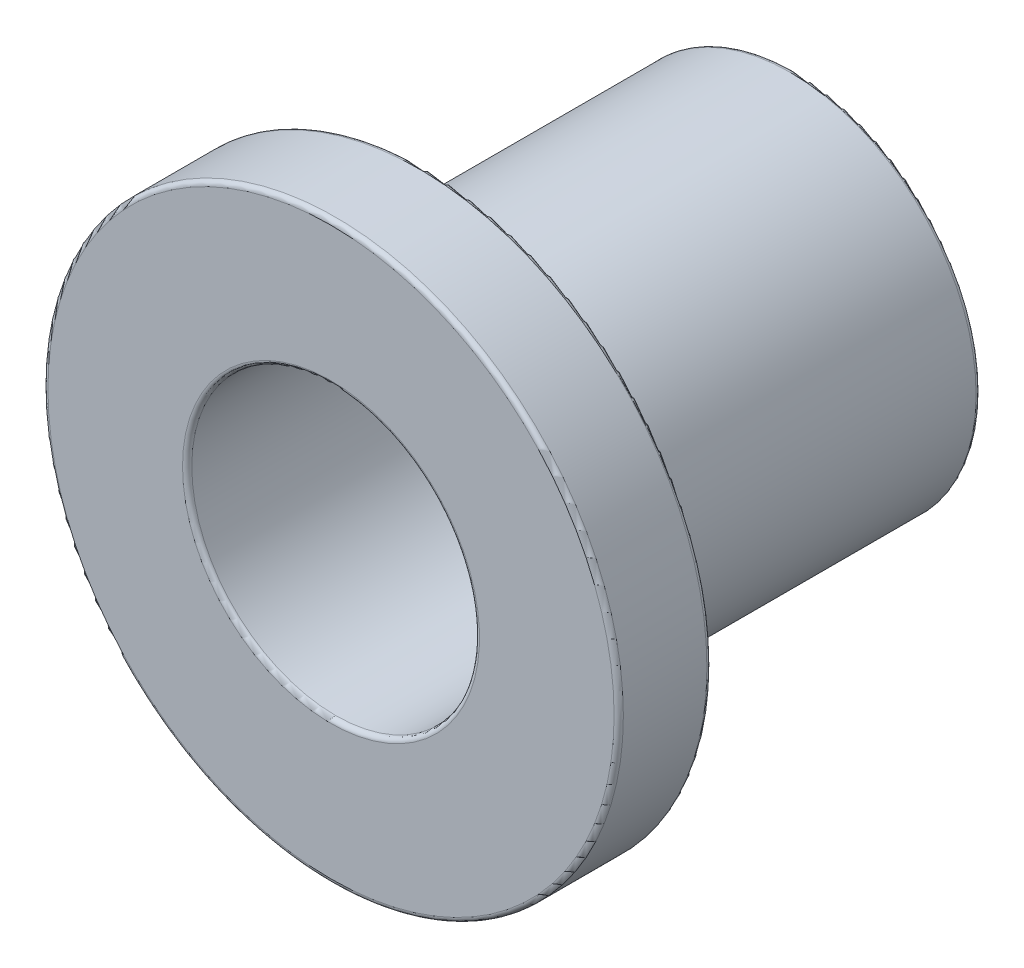
ISO-10303-21;
HEADER;
FILE_DESCRIPTION(('STEP AP214'),'2;1');
FILE_NAME('part.step','',(''),(''),'','','');
FILE_SCHEMA(('AUTOMOTIVE_DESIGN { 1 0 10303 214 1 1 1 1 }'));
ENDSEC;
DATA;
#1=APPLICATION_CONTEXT('core data for automotive mechanical design processes');
#2=APPLICATION_PROTOCOL_DEFINITION('international standard','automotive_design',2000,#1);
#3=PRODUCT_CONTEXT('',#1,'mechanical');
#4=PRODUCT('Part','Part','',(#3));
#5=PRODUCT_RELATED_PRODUCT_CATEGORY('part','',(#4));
#6=PRODUCT_DEFINITION_FORMATION('','',#4);
#7=PRODUCT_DEFINITION_CONTEXT('part definition',#1,'design');
#8=PRODUCT_DEFINITION('design','',#6,#7);
#9=PRODUCT_DEFINITION_SHAPE('','',#8);
#10=(LENGTH_UNIT() NAMED_UNIT(*) SI_UNIT(.MILLI.,.METRE.));
#11=(NAMED_UNIT(*) PLANE_ANGLE_UNIT() SI_UNIT($,.RADIAN.));
#12=(NAMED_UNIT(*) SI_UNIT($,.STERADIAN.) SOLID_ANGLE_UNIT());
#13=UNCERTAINTY_MEASURE_WITH_UNIT(LENGTH_MEASURE(1.E-05),#10,'distance_accuracy_value','');
#14=(GEOMETRIC_REPRESENTATION_CONTEXT(3) GLOBAL_UNCERTAINTY_ASSIGNED_CONTEXT((#13)) GLOBAL_UNIT_ASSIGNED_CONTEXT((#10,
#11,#12)) REPRESENTATION_CONTEXT('',''));
#15=CARTESIAN_POINT('',(0.,0.,0.));
#16=DIRECTION('',(0.,0.,1.));
#17=DIRECTION('',(1.,0.,0.));
#18=AXIS2_PLACEMENT_3D('',#15,#16,#17);
#19=CARTESIAN_POINT('',(0.,3.1,2.5));
#20=DIRECTION('',(0.,0.,-1.));
#21=DIRECTION('',(-1.,0.,0.));
#22=AXIS2_PLACEMENT_3D('',#19,#20,#21);
#23=PLANE('',#22);
#24=CARTESIAN_POINT('',(0.,0.,2.5));
#25=DIRECTION('',(0.,0.,-1.));
#26=DIRECTION('',(-1.,0.,0.));
#27=AXIS2_PLACEMENT_3D('',#24,#25,#26);
#28=CIRCLE('',#27,1.6);
#29=CARTESIAN_POINT('',(-1.6,0.,2.5));
#30=VERTEX_POINT('',#29);
#31=EDGE_CURVE('E62',#30,#30,#28,.T.);
#32=ORIENTED_EDGE('',*,*,#31,.T.);
#33=EDGE_LOOP('',(#32));
#34=FACE_BOUND('',#33,.T.);
#35=CARTESIAN_POINT('',(0.,0.,2.5));
#36=DIRECTION('',(0.,0.,-1.));
#37=DIRECTION('',(-1.,0.,0.));
#38=AXIS2_PLACEMENT_3D('',#35,#36,#37);
#39=CIRCLE('',#38,3.05);
#40=CARTESIAN_POINT('',(-3.05,0.,2.5));
#41=VERTEX_POINT('',#40);
#42=EDGE_CURVE('E65',#41,#41,#39,.F.);
#43=ORIENTED_EDGE('',*,*,#42,.T.);
#44=EDGE_LOOP('',(#43));
#45=FACE_BOUND('',#44,.T.);
#46=ADVANCED_FACE('F30',(#34,#45),#23,.F.);
#47=CARTESIAN_POINT('',(0.,0.,2.5));
#48=DIRECTION('',(0.,0.,1.));
#49=DIRECTION('',(1.,0.,0.));
#50=AXIS2_PLACEMENT_3D('',#47,#48,#49);
#51=CYLINDRICAL_SURFACE('',#50,1.55);
#52=CARTESIAN_POINT('',(0.,0.,2.45));
#53=DIRECTION('',(0.,0.,-1.));
#54=DIRECTION('',(-1.,0.,0.));
#55=AXIS2_PLACEMENT_3D('',#52,#53,#54);
#56=CIRCLE('',#55,1.55);
#57=CARTESIAN_POINT('',(-1.55,0.,2.45));
#58=VERTEX_POINT('',#57);
#59=EDGE_CURVE('E68',#58,#58,#56,.F.);
#60=ORIENTED_EDGE('',*,*,#59,.T.);
#61=EDGE_LOOP('',(#60));
#62=FACE_BOUND('',#61,.T.);
#63=CARTESIAN_POINT('',(0.,0.,-2.45));
#64=DIRECTION('',(0.,0.,1.));
#65=DIRECTION('',(1.,0.,0.));
#66=AXIS2_PLACEMENT_3D('',#63,#64,#65);
#67=CIRCLE('',#66,1.55);
#68=CARTESIAN_POINT('',(1.55,0.,-2.45));
#69=VERTEX_POINT('',#68);
#70=EDGE_CURVE('E71',#69,#69,#67,.F.);
#71=ORIENTED_EDGE('',*,*,#70,.T.);
#72=EDGE_LOOP('',(#71));
#73=FACE_BOUND('',#72,.T.);
#74=ADVANCED_FACE('F75',(#62,#73),#51,.F.);
#75=CARTESIAN_POINT('',(0.,1.55,-2.5));
#76=DIRECTION('',(0.,0.,1.));
#77=DIRECTION('',(1.,0.,0.));
#78=AXIS2_PLACEMENT_3D('',#75,#76,#77);
#79=PLANE('',#78);
#80=CARTESIAN_POINT('',(0.,0.,-2.5));
#81=DIRECTION('',(0.,0.,1.));
#82=DIRECTION('',(1.,0.,0.));
#83=AXIS2_PLACEMENT_3D('',#80,#81,#82);
#84=CIRCLE('',#83,1.6);
#85=CARTESIAN_POINT('',(1.6,0.,-2.5));
#86=VERTEX_POINT('',#85);
#87=EDGE_CURVE('E56',#86,#86,#84,.T.);
#88=ORIENTED_EDGE('',*,*,#87,.T.);
#89=EDGE_LOOP('',(#88));
#90=FACE_BOUND('',#89,.T.);
#91=CARTESIAN_POINT('',(0.,0.,-2.5));
#92=DIRECTION('',(0.,0.,1.));
#93=DIRECTION('',(1.,0.,0.));
#94=AXIS2_PLACEMENT_3D('',#91,#92,#93);
#95=CIRCLE('',#94,1.95);
#96=CARTESIAN_POINT('',(1.95,0.,-2.5));
#97=VERTEX_POINT('',#96);
#98=EDGE_CURVE('E59',#97,#97,#95,.F.);
#99=ORIENTED_EDGE('',*,*,#98,.T.);
#100=EDGE_LOOP('',(#99));
#101=FACE_BOUND('',#100,.T.);
#102=ADVANCED_FACE('F85',(#90,#101),#79,.F.);
#103=CARTESIAN_POINT('',(0.,0.,2.5));
#104=DIRECTION('',(0.,0.,1.));
#105=DIRECTION('',(1.,0.,0.));
#106=AXIS2_PLACEMENT_3D('',#103,#104,#105);
#107=CYLINDRICAL_SURFACE('',#106,2.);
#108=CARTESIAN_POINT('',(0.,0.,-2.45));
#109=DIRECTION('',(0.,0.,1.));
#110=DIRECTION('',(1.,0.,0.));
#111=AXIS2_PLACEMENT_3D('',#108,#109,#110);
#112=CIRCLE('',#111,2.);
#113=CARTESIAN_POINT('',(2.,0.,-2.45));
#114=VERTEX_POINT('',#113);
#115=EDGE_CURVE('E50',#114,#114,#112,.T.);
#116=ORIENTED_EDGE('',*,*,#115,.T.);
#117=EDGE_LOOP('',(#116));
#118=FACE_BOUND('',#117,.T.);
#119=CARTESIAN_POINT('',(0.,0.,1.45));
#120=DIRECTION('',(0.,0.,1.));
#121=DIRECTION('',(1.,0.,0.));
#122=AXIS2_PLACEMENT_3D('',#119,#120,#121);
#123=CIRCLE('',#122,2.);
#124=CARTESIAN_POINT('',(2.,0.,1.45));
#125=VERTEX_POINT('',#124);
#126=EDGE_CURVE('E53',#125,#125,#123,.F.);
#127=ORIENTED_EDGE('',*,*,#126,.T.);
#128=EDGE_LOOP('',(#127));
#129=FACE_BOUND('',#128,.T.);
#130=ADVANCED_FACE('F88',(#118,#129),#107,.T.);
#131=CARTESIAN_POINT('',(0.,2.,1.5));
#132=DIRECTION('',(0.,0.,1.));
#133=DIRECTION('',(1.,0.,0.));
#134=AXIS2_PLACEMENT_3D('',#131,#132,#133);
#135=PLANE('',#134);
#136=CARTESIAN_POINT('',(0.,0.,1.5));
#137=DIRECTION('',(0.,0.,1.));
#138=DIRECTION('',(1.,0.,0.));
#139=AXIS2_PLACEMENT_3D('',#136,#137,#138);
#140=CIRCLE('',#139,2.05);
#141=CARTESIAN_POINT('',(2.05,0.,1.5));
#142=VERTEX_POINT('',#141);
#143=EDGE_CURVE('E41',#142,#142,#140,.T.);
#144=ORIENTED_EDGE('',*,*,#143,.T.);
#145=EDGE_LOOP('',(#144));
#146=FACE_BOUND('',#145,.T.);
#147=CARTESIAN_POINT('',(0.,0.,1.5));
#148=DIRECTION('',(0.,0.,1.));
#149=DIRECTION('',(1.,0.,0.));
#150=AXIS2_PLACEMENT_3D('',#147,#148,#149);
#151=CIRCLE('',#150,3.05);
#152=CARTESIAN_POINT('',(3.05,0.,1.5));
#153=VERTEX_POINT('',#152);
#154=EDGE_CURVE('E45',#153,#153,#151,.F.);
#155=ORIENTED_EDGE('',*,*,#154,.T.);
#156=EDGE_LOOP('',(#155));
#157=FACE_BOUND('',#156,.T.);
#158=ADVANCED_FACE('F100',(#146,#157),#135,.F.);
#159=CARTESIAN_POINT('',(0.,0.,2.5));
#160=DIRECTION('',(0.,0.,1.));
#161=DIRECTION('',(1.,0.,0.));
#162=AXIS2_PLACEMENT_3D('',#159,#160,#161);
#163=CYLINDRICAL_SURFACE('',#162,3.1);
#164=CARTESIAN_POINT('',(0.,0.,1.55));
#165=DIRECTION('',(0.,0.,1.));
#166=DIRECTION('',(1.,0.,0.));
#167=AXIS2_PLACEMENT_3D('',#164,#165,#166);
#168=CIRCLE('',#167,3.1);
#169=CARTESIAN_POINT('',(3.1,0.,1.55));
#170=VERTEX_POINT('',#169);
#171=EDGE_CURVE('E10',#170,#170,#168,.T.);
#172=ORIENTED_EDGE('',*,*,#171,.T.);
#173=EDGE_LOOP('',(#172));
#174=FACE_BOUND('',#173,.T.);
#175=CARTESIAN_POINT('',(0.,0.,2.45));
#176=DIRECTION('',(0.,0.,-1.));
#177=DIRECTION('',(-1.,0.,0.));
#178=AXIS2_PLACEMENT_3D('',#175,#176,#177);
#179=CIRCLE('',#178,3.1);
#180=CARTESIAN_POINT('',(-3.1,0.,2.45));
#181=VERTEX_POINT('',#180);
#182=EDGE_CURVE('E37',#181,#181,#179,.T.);
#183=ORIENTED_EDGE('',*,*,#182,.T.);
#184=EDGE_LOOP('',(#183));
#185=FACE_BOUND('',#184,.T.);
#186=ADVANCED_FACE('F112',(#174,#185),#163,.T.);
#187=CARTESIAN_POINT('',(0.,0.,2.45));
#188=DIRECTION('',(0.,0.,-1.));
#189=DIRECTION('',(-1.,0.,0.));
#190=AXIS2_PLACEMENT_3D('',#187,#188,#189);
#191=TOROIDAL_SURFACE('',#190,1.6,0.05);
#192=ORIENTED_EDGE('',*,*,#31,.F.);
#193=EDGE_LOOP('',(#192));
#194=FACE_BOUND('',#193,.T.);
#195=ORIENTED_EDGE('',*,*,#59,.F.);
#196=EDGE_LOOP('',(#195));
#197=FACE_BOUND('',#196,.T.);
#198=ADVANCED_FACE('F81',(#194,#197),#191,.T.);
#199=CARTESIAN_POINT('',(0.,0.,-2.45));
#200=DIRECTION('',(0.,0.,1.));
#201=DIRECTION('',(1.,0.,0.));
#202=AXIS2_PLACEMENT_3D('',#199,#200,#201);
#203=TOROIDAL_SURFACE('',#202,1.6,0.05);
#204=ORIENTED_EDGE('',*,*,#70,.F.);
#205=EDGE_LOOP('',(#204));
#206=FACE_BOUND('',#205,.T.);
#207=ORIENTED_EDGE('',*,*,#87,.F.);
#208=EDGE_LOOP('',(#207));
#209=FACE_BOUND('',#208,.T.);
#210=ADVANCED_FACE('F77',(#206,#209),#203,.T.);
#211=CARTESIAN_POINT('',(0.,0.,-2.45));
#212=DIRECTION('',(0.,0.,1.));
#213=DIRECTION('',(1.,0.,0.));
#214=AXIS2_PLACEMENT_3D('',#211,#212,#213);
#215=TOROIDAL_SURFACE('',#214,1.95,0.05);
#216=ORIENTED_EDGE('',*,*,#98,.F.);
#217=EDGE_LOOP('',(#216));
#218=FACE_BOUND('',#217,.T.);
#219=ORIENTED_EDGE('',*,*,#115,.F.);
#220=EDGE_LOOP('',(#219));
#221=FACE_BOUND('',#220,.T.);
#222=ADVANCED_FACE('F80',(#218,#221),#215,.T.);
#223=CARTESIAN_POINT('',(0.,0.,1.45));
#224=DIRECTION('',(0.,0.,1.));
#225=DIRECTION('',(1.,0.,0.));
#226=AXIS2_PLACEMENT_3D('',#223,#224,#225);
#227=TOROIDAL_SURFACE('',#226,2.05,0.05);
#228=ORIENTED_EDGE('',*,*,#126,.F.);
#229=EDGE_LOOP('',(#228));
#230=FACE_BOUND('',#229,.T.);
#231=ORIENTED_EDGE('',*,*,#143,.F.);
#232=EDGE_LOOP('',(#231));
#233=FACE_BOUND('',#232,.T.);
#234=ADVANCED_FACE('F94',(#230,#233),#227,.F.);
#235=CARTESIAN_POINT('',(0.,0.,1.55));
#236=DIRECTION('',(0.,0.,1.));
#237=DIRECTION('',(1.,0.,0.));
#238=AXIS2_PLACEMENT_3D('',#235,#236,#237);
#239=TOROIDAL_SURFACE('',#238,3.05,0.05);
#240=ORIENTED_EDGE('',*,*,#154,.F.);
#241=EDGE_LOOP('',(#240));
#242=FACE_BOUND('',#241,.T.);
#243=ORIENTED_EDGE('',*,*,#171,.F.);
#244=EDGE_LOOP('',(#243));
#245=FACE_BOUND('',#244,.T.);
#246=ADVANCED_FACE('F106',(#242,#245),#239,.T.);
#247=CARTESIAN_POINT('',(0.,0.,2.45));
#248=DIRECTION('',(0.,0.,-1.));
#249=DIRECTION('',(-1.,0.,0.));
#250=AXIS2_PLACEMENT_3D('',#247,#248,#249);
#251=TOROIDAL_SURFACE('',#250,3.05,0.05);
#252=ORIENTED_EDGE('',*,*,#182,.F.);
#253=EDGE_LOOP('',(#252));
#254=FACE_BOUND('',#253,.T.);
#255=ORIENTED_EDGE('',*,*,#42,.F.);
#256=EDGE_LOOP('',(#255));
#257=FACE_BOUND('',#256,.T.);
#258=ADVANCED_FACE('F32',(#254,#257),#251,.T.);
#259=CLOSED_SHELL('',(#46,#74,#102,#130,#158,#186,#198,#210,#222,#234,#246,#258));
#260=MANIFOLD_SOLID_BREP('B2',#259);
#261=ADVANCED_BREP_SHAPE_REPRESENTATION('',(#18,#260),#14);
#262=SHAPE_DEFINITION_REPRESENTATION(#9,#261);
ENDSEC;
END-ISO-10303-21;
